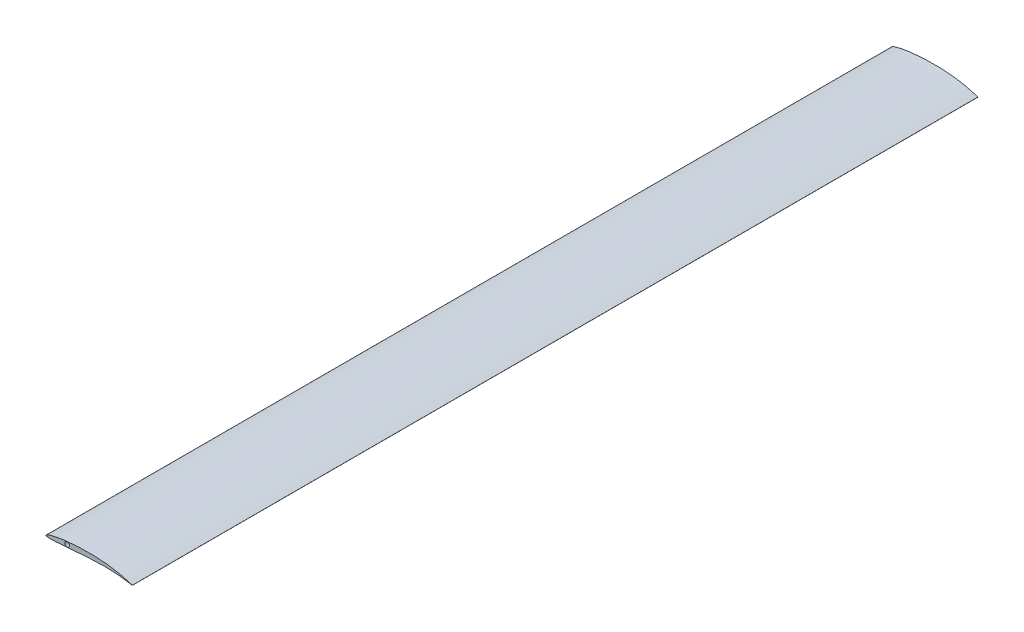
ISO-10303-21;
HEADER;
FILE_DESCRIPTION(('STEP AP214'),'2;1');
FILE_NAME('part.step','',(''),(''),'','','');
FILE_SCHEMA(('AUTOMOTIVE_DESIGN { 1 0 10303 214 1 1 1 1 }'));
ENDSEC;
DATA;
#1=APPLICATION_CONTEXT('core data for automotive mechanical design processes');
#2=APPLICATION_PROTOCOL_DEFINITION('international standard','automotive_design',2000,#1);
#3=PRODUCT_CONTEXT('',#1,'mechanical');
#4=PRODUCT('Part','Part','',(#3));
#5=PRODUCT_RELATED_PRODUCT_CATEGORY('part','',(#4));
#6=PRODUCT_DEFINITION_FORMATION('','',#4);
#7=PRODUCT_DEFINITION_CONTEXT('part definition',#1,'design');
#8=PRODUCT_DEFINITION('design','',#6,#7);
#9=PRODUCT_DEFINITION_SHAPE('','',#8);
#10=(LENGTH_UNIT() NAMED_UNIT(*) SI_UNIT(.MILLI.,.METRE.));
#11=(NAMED_UNIT(*) PLANE_ANGLE_UNIT() SI_UNIT($,.RADIAN.));
#12=(NAMED_UNIT(*) SI_UNIT($,.STERADIAN.) SOLID_ANGLE_UNIT());
#13=UNCERTAINTY_MEASURE_WITH_UNIT(LENGTH_MEASURE(1.E-05),#10,'distance_accuracy_value','');
#14=(GEOMETRIC_REPRESENTATION_CONTEXT(3) GLOBAL_UNCERTAINTY_ASSIGNED_CONTEXT((#13)) GLOBAL_UNIT_ASSIGNED_CONTEXT((#10,
#11,#12)) REPRESENTATION_CONTEXT('',''));
#15=CARTESIAN_POINT('',(0.,0.,0.));
#16=DIRECTION('',(0.,0.,1.));
#17=DIRECTION('',(1.,0.,0.));
#18=AXIS2_PLACEMENT_3D('',#15,#16,#17);
#19=CARTESIAN_POINT('',(0.525401804528747,0.872665163015105,1524.));
#20=DIRECTION('',(0.,0.,-1.));
#21=DIRECTION('',(-1.,0.,0.));
#22=AXIS2_PLACEMENT_3D('',#19,#20,#21);
#23=PLANE('',#22);
#24=CARTESIAN_POINT('',(155.702,0.09809226,1524.));
#25=CARTESIAN_POINT('',(155.3284558553,0.21710942035594,1524.));
#26=CARTESIAN_POINT('',(154.286379592531,0.549131644312494,1524.));
#27=CARTESIAN_POINT('',(152.394434018514,1.13581789793689,1524.));
#28=CARTESIAN_POINT('',(149.891446958605,1.88722412189287,1524.));
#29=CARTESIAN_POINT('',(145.793800914538,3.06570542874273,1524.));
#30=CARTESIAN_POINT('',(138.63018294362,4.96895950803595,1524.));
#31=CARTESIAN_POINT('',(130.995988523734,6.68001387034383,1524.));
#32=CARTESIAN_POINT('',(122.718135251343,8.23822641028946,1524.));
#33=CARTESIAN_POINT('',(116.895890211187,9.1669332436809,1524.));
#34=CARTESIAN_POINT('',(110.965655093805,9.93786873542115,1524.));
#35=CARTESIAN_POINT('',(106.439374347078,10.4355304241508,1524.));
#36=CARTESIAN_POINT('',(101.8800302122,10.8435128286841,1524.));
#37=CARTESIAN_POINT('',(97.3023620828505,11.1613375190947,1524.));
#38=CARTESIAN_POINT('',(92.7193250753117,11.3761631186527,1524.));
#39=CARTESIAN_POINT('',(88.1453758425879,11.5296260540284,1524.));
#40=CARTESIAN_POINT('',(83.5919730289418,11.6364959817345,1524.));
#41=CARTESIAN_POINT('',(77.5937160238076,11.7103246590463,1524.));
#42=CARTESIAN_POINT('',(71.6583323599073,11.685336347403,1524.));
#43=CARTESIAN_POINT('',(64.3955458542361,11.5289598804677,1524.));
#44=CARTESIAN_POINT('',(58.7294518068982,11.3089513302016,1524.));
#45=CARTESIAN_POINT('',(53.1798499910998,10.9924087613946,1524.));
#46=CARTESIAN_POINT('',(49.158789871168,10.7138031622318,1524.));
#47=CARTESIAN_POINT('',(45.2445946235121,10.3938147479918,1524.));
#48=CARTESIAN_POINT('',(41.4452023461841,10.0348604506325,1524.));
#49=CARTESIAN_POINT('',(37.7682829872048,9.63979813773975,1524.));
#50=CARTESIAN_POINT('',(34.2213123330204,9.21151904176136,1524.));
#51=CARTESIAN_POINT('',(30.8115271305712,8.75335646956328,1524.));
#52=CARTESIAN_POINT('',(27.5459898910303,8.2687115409572,1524.));
#53=CARTESIAN_POINT('',(24.4315558878002,7.76125975695687,1524.));
#54=CARTESIAN_POINT('',(21.474930217381,7.23477382786033,1524.));
#55=CARTESIAN_POINT('',(18.6826260388899,6.69326818166757,1524.));
#56=CARTESIAN_POINT('',(16.0610248859551,6.14072241384211,1524.));
#57=CARTESIAN_POINT('',(13.6163514767167,5.58123683702117,1524.));
#58=CARTESIAN_POINT('',(11.354657589497,5.01899174489703,1524.));
#59=CARTESIAN_POINT('',(9.28189004841098,4.45804318927709,1524.));
#60=CARTESIAN_POINT('',(7.40381333161797,3.90246845818611,1524.));
#61=CARTESIAN_POINT('',(5.72603374089783,3.35624415940243,1524.));
#62=CARTESIAN_POINT('',(4.25396605844636,2.82311362786691,1524.));
#63=CARTESIAN_POINT('',(2.99264591262698,2.30692318188395,1524.));
#64=CARTESIAN_POINT('',(1.94675417840804,1.81068520043617,1524.));
#65=CARTESIAN_POINT('',(1.11946567026023,1.33845579257681,1524.));
#66=CARTESIAN_POINT('',(0.512415950317857,0.888835225589004,1524.));
#67=CARTESIAN_POINT('',(0.119562153788262,0.462964377166334,1524.));
#68=CARTESIAN_POINT('',(-0.0492678595732266,0.0142016169626996,1524.));
#69=CARTESIAN_POINT('',(0.105897750369786,-0.415412747386477,1524.));
#70=CARTESIAN_POINT('',(0.520541366310002,-0.722853172688327,1524.));
#71=CARTESIAN_POINT('',(1.12920170506311,-0.970029586177184,1524.));
#72=CARTESIAN_POINT('',(1.9577398623943,-1.17009878108616,1524.));
#73=CARTESIAN_POINT('',(3.00247648729025,-1.32560916480063,1524.));
#74=CARTESIAN_POINT('',(4.26301779834516,-1.43690619309591,1524.));
#75=CARTESIAN_POINT('',(5.73422144562208,-1.50478830501902,1524.));
#76=CARTESIAN_POINT('',(7.41130069894125,-1.53045233437144,1524.));
#77=CARTESIAN_POINT('',(9.28876761435492,-1.51533320486841,1524.));
#78=CARTESIAN_POINT('',(11.3610140404189,-1.46108450467701,1524.));
#79=CARTESIAN_POINT('',(13.6222390898554,-1.36966255039926,1524.));
#80=CARTESIAN_POINT('',(16.0664917094409,-1.24309770203797,1524.));
#81=CARTESIAN_POINT('',(18.6876947710045,-1.083738204904,1524.));
#82=CARTESIAN_POINT('',(21.4796084463121,-0.893954737003242,1524.));
#83=CARTESIAN_POINT('',(24.4358612796768,-0.67648534031803,1524.));
#84=CARTESIAN_POINT('',(27.5499144660739,-0.434035782526698,1524.));
#85=CARTESIAN_POINT('',(30.8150706083519,-0.169587971307873,1524.));
#86=CARTESIAN_POINT('',(34.2244674982915,0.113769109898979,1524.));
#87=CARTESIAN_POINT('',(37.7710507217415,0.412820725321326,1524.));
#88=CARTESIAN_POINT('',(41.4475731590064,0.724258515605107,1524.));
#89=CARTESIAN_POINT('',(45.2465713873692,1.04472146189352,1524.));
#90=CARTESIAN_POINT('',(49.1603750794306,1.37067467274429,1524.));
#91=CARTESIAN_POINT('',(53.1810472874107,1.69875654472471,1524.));
#92=CARTESIAN_POINT('',(58.7310934112926,2.13891625095822,1524.));
#93=CARTESIAN_POINT('',(65.8715142279846,2.67438646003037,1524.));
#94=CARTESIAN_POINT('',(73.1340385714778,3.16363780617084,1524.));
#95=CARTESIAN_POINT('',(79.0693703699002,3.52254709679583,1524.));
#96=CARTESIAN_POINT('',(83.5908901555847,3.77384205750244,1524.));
#97=CARTESIAN_POINT('',(88.1441154412296,4.0021631409997,1524.));
#98=CARTESIAN_POINT('',(92.717191906114,4.20961080150113,1524.));
#99=CARTESIAN_POINT('',(97.2984728585409,4.3792036165322,1524.));
#100=CARTESIAN_POINT('',(101.875937349907,4.46664553107566,1524.));
#101=CARTESIAN_POINT('',(106.434975089222,4.48228755306944,1524.));
#102=CARTESIAN_POINT('',(110.961062662525,4.42400453658744,1524.));
#103=CARTESIAN_POINT('',(116.884864025516,4.25253430316624,1524.));
#104=CARTESIAN_POINT('',(124.077709926948,3.87360796895395,1524.));
#105=CARTESIAN_POINT('',(132.343195007114,3.18478996582521,1524.));
#106=CARTESIAN_POINT('',(138.866298944054,2.45410016104777,1524.));
#107=CARTESIAN_POINT('',(143.705151457092,1.8156145112589,1524.));
#108=CARTESIAN_POINT('',(146.962607739574,1.34652287539088,1524.));
#109=CARTESIAN_POINT('',(149.888855120236,0.893212117335907,1524.));
#110=CARTESIAN_POINT('',(152.392639903493,0.480978032682383,1524.));
#111=CARTESIAN_POINT('',(154.285403175287,0.155019879199055,1524.));
#112=CARTESIAN_POINT('',(155.328395834426,-0.0313380869618917,1524.));
#113=CARTESIAN_POINT('',(155.702,-0.09809226,1524.));
#114=B_SPLINE_CURVE_WITH_KNOTS('',3,(#24,#25,#26,#27,#28,#29,#30,#31,#32,#33,#34,#35,#36,#37,
#38,#39,#40,#41,#42,#43,#44,#45,#46,#47,#48,#49,#50,#51,#52,#53,#54,#55,#56,#57,#58,#59,#60,#61,
#62,#63,#64,#65,#66,#67,#68,#69,#70,#71,#72,#73,#74,#75,#76,#77,#78,#79,#80,#81,#82,#83,#84,#85,
#86,#87,#88,#89,#90,#91,#92,#93,#94,#95,#96,#97,#98,#99,#100,#101,#102,#103,#104,#105,#106,#107,
#108,#109,#110,#111,#112,#113),.UNSPECIFIED.,.F.,.F.,(4,1,1,1,1,1,1,1,1,1,1,1,1,1,1,1,1,1,1,1,1,
1,1,1,1,1,1,1,1,1,1,1,1,1,1,1,1,1,1,1,1,1,1,1,1,1,1,1,1,1,1,1,1,1,1,1,1,1,1,1,1,1,1,1,1,1,1,1,1,
1,1,1,1,1,1,1,1,1,1,1,1,1,1,1,1,1,1,4),(0.,0.00372899313572629,0.0104027737709402,
0.0188405681091252,0.0285857090219877,0.0509568654463618,0.0893342705761814,0.102976570028767,
0.131071144946394,0.145402462066134,0.159853792798743,0.174379924165424,0.188939765995605,
0.203496108228615,0.218017345652983,0.232469301823207,0.246817477060529,0.275073666804327,
0.288921089564929,0.315912881852729,0.329003976978422,0.341791348126529,0.354250441074044,
0.366357574957908,0.378089701143569,0.389424235307972,0.400339091312672,0.410812773460301,
0.420824000924857,0.430352033095254,0.439376412436803,0.447877060843406,0.455834383426044,
0.463229144178333,0.470042802143181,0.476257372386531,0.481856008580791,0.486823220679453,
0.491145841818725,0.49481444479107,0.497826693193043,0.50019535908403,0.501969932436351,
0.503300070481987,0.504508603814003,0.506012741551414,0.508062770734561,0.510747121987725,
0.514093104606869,0.518105082605802,0.522777317910467,0.528099107282482,0.534056683384844,
0.54063448129877,0.547815449226327,0.555581622315945,0.563914059121092,0.572793129232771,
0.582198375734924,0.592108706915711,0.602502417276948,0.613356987376676,0.624649416693531,
0.636355908808304,0.648451946947934,0.660912408031849,0.673711424560329,0.686822170180073,
0.713868083313977,0.741818751280604,0.75605650564263,0.770425668646667,0.784891945827016,
0.799419293905974,0.813967731261913,0.82849578318469,0.842964095160687,0.857330143238578,
0.871547876317039,0.899330310053235,0.925831588486519,0.950429235569147,0.961757467348133,
0.972254713902714,0.981731904954293,0.989922337683984,0.996390140824557,1.),.UNSPECIFIED.);
#115=CARTESIAN_POINT('',(155.702,0.09809226,1524.));
#116=VERTEX_POINT('',#115);
#117=CARTESIAN_POINT('',(155.702,-0.09809226,1524.));
#118=VERTEX_POINT('',#117);
#119=EDGE_CURVE('E69',#116,#118,#114,.T.);
#120=ORIENTED_EDGE('',*,*,#119,.T.);
#121=DIRECTION('',(0.,1.,0.));
#122=VECTOR('',#121,1.);
#123=CARTESIAN_POINT('',(155.702,0.09809226,1524.));
#124=LINE('',#123,#122);
#125=EDGE_CURVE('E54',#118,#116,#124,.T.);
#126=ORIENTED_EDGE('',*,*,#125,.T.);
#127=EDGE_LOOP('',(#120,#126));
#128=FACE_BOUND('',#127,.T.);
#129=CARTESIAN_POINT('',(38.058872586786,5.05107898487344,1524.));
#130=DIRECTION('',(0.,0.,1.));
#131=DIRECTION('',(1.,0.,0.));
#132=AXIS2_PLACEMENT_3D('',#129,#130,#131);
#133=CIRCLE('',#132,4.19056940693637);
#134=CARTESIAN_POINT('',(42.2494419937224,5.05107898487344,1524.));
#135=VERTEX_POINT('',#134);
#136=EDGE_CURVE('E75',#135,#135,#133,.T.);
#137=ORIENTED_EDGE('',*,*,#136,.F.);
#138=EDGE_LOOP('',(#137));
#139=FACE_BOUND('',#138,.T.);
#140=ADVANCED_FACE('F37',(#128,#139),#23,.F.);
#141=CARTESIAN_POINT('',(0.525401804528747,0.872665163015105,0.));
#142=DIRECTION('',(0.,0.,-1.));
#143=DIRECTION('',(-1.,0.,0.));
#144=AXIS2_PLACEMENT_3D('',#141,#142,#143);
#145=PLANE('',#144);
#146=CARTESIAN_POINT('',(155.702,0.09809226,0.));
#147=CARTESIAN_POINT('',(155.3284558553,0.21710942035594,0.));
#148=CARTESIAN_POINT('',(154.286379592531,0.549131644312494,0.));
#149=CARTESIAN_POINT('',(152.394434018514,1.13581789793689,0.));
#150=CARTESIAN_POINT('',(149.891446958605,1.88722412189287,0.));
#151=CARTESIAN_POINT('',(145.793800914538,3.06570542874273,0.));
#152=CARTESIAN_POINT('',(138.63018294362,4.96895950803595,0.));
#153=CARTESIAN_POINT('',(130.995988523734,6.68001387034383,0.));
#154=CARTESIAN_POINT('',(122.718135251343,8.23822641028946,0.));
#155=CARTESIAN_POINT('',(116.895890211187,9.1669332436809,0.));
#156=CARTESIAN_POINT('',(110.965655093805,9.93786873542115,0.));
#157=CARTESIAN_POINT('',(106.439374347078,10.4355304241508,0.));
#158=CARTESIAN_POINT('',(101.8800302122,10.8435128286841,0.));
#159=CARTESIAN_POINT('',(97.3023620828505,11.1613375190947,0.));
#160=CARTESIAN_POINT('',(92.7193250753117,11.3761631186527,0.));
#161=CARTESIAN_POINT('',(88.1453758425879,11.5296260540284,0.));
#162=CARTESIAN_POINT('',(83.5919730289418,11.6364959817345,0.));
#163=CARTESIAN_POINT('',(77.5937160238076,11.7103246590463,0.));
#164=CARTESIAN_POINT('',(71.6583323599073,11.685336347403,0.));
#165=CARTESIAN_POINT('',(64.3955458542361,11.5289598804677,0.));
#166=CARTESIAN_POINT('',(58.7294518068982,11.3089513302016,0.));
#167=CARTESIAN_POINT('',(53.1798499910998,10.9924087613946,0.));
#168=CARTESIAN_POINT('',(49.158789871168,10.7138031622318,0.));
#169=CARTESIAN_POINT('',(45.2445946235121,10.3938147479918,0.));
#170=CARTESIAN_POINT('',(41.4452023461841,10.0348604506325,0.));
#171=CARTESIAN_POINT('',(37.7682829872048,9.63979813773975,0.));
#172=CARTESIAN_POINT('',(34.2213123330204,9.21151904176136,0.));
#173=CARTESIAN_POINT('',(30.8115271305712,8.75335646956328,0.));
#174=CARTESIAN_POINT('',(27.5459898910303,8.2687115409572,0.));
#175=CARTESIAN_POINT('',(24.4315558878002,7.76125975695687,0.));
#176=CARTESIAN_POINT('',(21.474930217381,7.23477382786033,0.));
#177=CARTESIAN_POINT('',(18.6826260388899,6.69326818166757,0.));
#178=CARTESIAN_POINT('',(16.0610248859551,6.14072241384211,0.));
#179=CARTESIAN_POINT('',(13.6163514767167,5.58123683702117,0.));
#180=CARTESIAN_POINT('',(11.354657589497,5.01899174489703,0.));
#181=CARTESIAN_POINT('',(9.28189004841098,4.45804318927709,0.));
#182=CARTESIAN_POINT('',(7.40381333161797,3.90246845818611,0.));
#183=CARTESIAN_POINT('',(5.72603374089783,3.35624415940243,0.));
#184=CARTESIAN_POINT('',(4.25396605844636,2.82311362786691,0.));
#185=CARTESIAN_POINT('',(2.99264591262698,2.30692318188395,0.));
#186=CARTESIAN_POINT('',(1.94675417840804,1.81068520043617,0.));
#187=CARTESIAN_POINT('',(1.11946567026023,1.33845579257681,0.));
#188=CARTESIAN_POINT('',(0.512415950317857,0.888835225589004,0.));
#189=CARTESIAN_POINT('',(0.119562153788262,0.462964377166334,0.));
#190=CARTESIAN_POINT('',(-0.0492678595732266,0.0142016169626996,0.));
#191=CARTESIAN_POINT('',(0.105897750369786,-0.415412747386477,0.));
#192=CARTESIAN_POINT('',(0.520541366310002,-0.722853172688327,0.));
#193=CARTESIAN_POINT('',(1.12920170506311,-0.970029586177184,0.));
#194=CARTESIAN_POINT('',(1.9577398623943,-1.17009878108616,0.));
#195=CARTESIAN_POINT('',(3.00247648729025,-1.32560916480063,0.));
#196=CARTESIAN_POINT('',(4.26301779834516,-1.43690619309591,0.));
#197=CARTESIAN_POINT('',(5.73422144562208,-1.50478830501902,0.));
#198=CARTESIAN_POINT('',(7.41130069894125,-1.53045233437144,0.));
#199=CARTESIAN_POINT('',(9.28876761435492,-1.51533320486841,0.));
#200=CARTESIAN_POINT('',(11.3610140404189,-1.46108450467701,0.));
#201=CARTESIAN_POINT('',(13.6222390898554,-1.36966255039926,0.));
#202=CARTESIAN_POINT('',(16.0664917094409,-1.24309770203797,0.));
#203=CARTESIAN_POINT('',(18.6876947710045,-1.083738204904,0.));
#204=CARTESIAN_POINT('',(21.4796084463121,-0.893954737003242,0.));
#205=CARTESIAN_POINT('',(24.4358612796768,-0.67648534031803,0.));
#206=CARTESIAN_POINT('',(27.5499144660739,-0.434035782526698,0.));
#207=CARTESIAN_POINT('',(30.8150706083519,-0.169587971307873,0.));
#208=CARTESIAN_POINT('',(34.2244674982915,0.113769109898979,0.));
#209=CARTESIAN_POINT('',(37.7710507217415,0.412820725321326,0.));
#210=CARTESIAN_POINT('',(41.4475731590064,0.724258515605107,0.));
#211=CARTESIAN_POINT('',(45.2465713873692,1.04472146189352,0.));
#212=CARTESIAN_POINT('',(49.1603750794306,1.37067467274429,0.));
#213=CARTESIAN_POINT('',(53.1810472874107,1.69875654472471,0.));
#214=CARTESIAN_POINT('',(58.7310934112926,2.13891625095822,0.));
#215=CARTESIAN_POINT('',(65.8715142279846,2.67438646003037,0.));
#216=CARTESIAN_POINT('',(73.1340385714778,3.16363780617084,0.));
#217=CARTESIAN_POINT('',(79.0693703699002,3.52254709679583,0.));
#218=CARTESIAN_POINT('',(83.5908901555847,3.77384205750244,0.));
#219=CARTESIAN_POINT('',(88.1441154412296,4.0021631409997,0.));
#220=CARTESIAN_POINT('',(92.717191906114,4.20961080150113,0.));
#221=CARTESIAN_POINT('',(97.2984728585409,4.3792036165322,0.));
#222=CARTESIAN_POINT('',(101.875937349907,4.46664553107566,0.));
#223=CARTESIAN_POINT('',(106.434975089222,4.48228755306944,0.));
#224=CARTESIAN_POINT('',(110.961062662525,4.42400453658744,0.));
#225=CARTESIAN_POINT('',(116.884864025516,4.25253430316624,0.));
#226=CARTESIAN_POINT('',(124.077709926948,3.87360796895395,0.));
#227=CARTESIAN_POINT('',(132.343195007114,3.18478996582521,0.));
#228=CARTESIAN_POINT('',(138.866298944054,2.45410016104777,0.));
#229=CARTESIAN_POINT('',(143.705151457092,1.8156145112589,0.));
#230=CARTESIAN_POINT('',(146.962607739574,1.34652287539088,0.));
#231=CARTESIAN_POINT('',(149.888855120236,0.893212117335907,0.));
#232=CARTESIAN_POINT('',(152.392639903493,0.480978032682383,0.));
#233=CARTESIAN_POINT('',(154.285403175287,0.155019879199055,0.));
#234=CARTESIAN_POINT('',(155.328395834426,-0.0313380869618917,0.));
#235=CARTESIAN_POINT('',(155.702,-0.09809226,0.));
#236=B_SPLINE_CURVE_WITH_KNOTS('',3,(#146,#147,#148,#149,#150,#151,#152,#153,#154,#155,#156,
#157,#158,#159,#160,#161,#162,#163,#164,#165,#166,#167,#168,#169,#170,#171,#172,#173,#174,#175,
#176,#177,#178,#179,#180,#181,#182,#183,#184,#185,#186,#187,#188,#189,#190,#191,#192,#193,#194,
#195,#196,#197,#198,#199,#200,#201,#202,#203,#204,#205,#206,#207,#208,#209,#210,#211,#212,#213,
#214,#215,#216,#217,#218,#219,#220,#221,#222,#223,#224,#225,#226,#227,#228,#229,#230,#231,#232,
#233,#234,#235),.UNSPECIFIED.,.F.,.F.,(4,1,1,1,1,1,1,1,1,1,1,1,1,1,1,1,1,1,1,1,1,1,1,1,1,1,1,1,
1,1,1,1,1,1,1,1,1,1,1,1,1,1,1,1,1,1,1,1,1,1,1,1,1,1,1,1,1,1,1,1,1,1,1,1,1,1,1,1,1,1,1,1,1,1,1,1,
1,1,1,1,1,1,1,1,1,1,1,4),(0.,0.00372899313572629,0.0104027737709402,0.0188405681091252,
0.0285857090219877,0.0509568654463618,0.0893342705761814,0.102976570028767,0.131071144946394,
0.145402462066134,0.159853792798743,0.174379924165424,0.188939765995605,0.203496108228615,
0.218017345652983,0.232469301823207,0.246817477060529,0.275073666804327,0.288921089564929,
0.315912881852729,0.329003976978422,0.341791348126529,0.354250441074044,0.366357574957908,
0.378089701143569,0.389424235307972,0.400339091312672,0.410812773460301,0.420824000924857,
0.430352033095254,0.439376412436803,0.447877060843406,0.455834383426044,0.463229144178333,
0.470042802143181,0.476257372386531,0.481856008580791,0.486823220679453,0.491145841818725,
0.49481444479107,0.497826693193043,0.50019535908403,0.501969932436351,0.503300070481987,
0.504508603814003,0.506012741551414,0.508062770734561,0.510747121987725,0.514093104606869,
0.518105082605802,0.522777317910467,0.528099107282482,0.534056683384844,0.54063448129877,
0.547815449226327,0.555581622315945,0.563914059121092,0.572793129232771,0.582198375734924,
0.592108706915711,0.602502417276948,0.613356987376676,0.624649416693531,0.636355908808304,
0.648451946947934,0.660912408031849,0.673711424560329,0.686822170180073,0.713868083313977,
0.741818751280604,0.75605650564263,0.770425668646667,0.784891945827016,0.799419293905974,
0.813967731261913,0.82849578318469,0.842964095160687,0.857330143238578,0.871547876317039,
0.899330310053235,0.925831588486519,0.950429235569147,0.961757467348133,0.972254713902714,
0.981731904954293,0.989922337683984,0.996390140824557,1.),.UNSPECIFIED.);
#237=CARTESIAN_POINT('',(155.702,0.09809226,0.));
#238=VERTEX_POINT('',#237);
#239=CARTESIAN_POINT('',(155.702,-0.09809226,0.));
#240=VERTEX_POINT('',#239);
#241=EDGE_CURVE('E70',#238,#240,#236,.T.);
#242=ORIENTED_EDGE('',*,*,#241,.F.);
#243=DIRECTION('',(0.,1.,0.));
#244=VECTOR('',#243,1.);
#245=CARTESIAN_POINT('',(155.702,0.09809226,0.));
#246=LINE('',#245,#244);
#247=EDGE_CURVE('E62',#240,#238,#246,.T.);
#248=ORIENTED_EDGE('',*,*,#247,.F.);
#249=EDGE_LOOP('',(#242,#248));
#250=FACE_BOUND('',#249,.T.);
#251=CARTESIAN_POINT('',(38.058872586786,5.05107898487344,0.));
#252=DIRECTION('',(0.,0.,1.));
#253=DIRECTION('',(1.,0.,0.));
#254=AXIS2_PLACEMENT_3D('',#251,#252,#253);
#255=CIRCLE('',#254,4.19056940693637);
#256=CARTESIAN_POINT('',(42.2494419937224,5.05107898487344,0.));
#257=VERTEX_POINT('',#256);
#258=EDGE_CURVE('E78',#257,#257,#255,.T.);
#259=ORIENTED_EDGE('',*,*,#258,.T.);
#260=EDGE_LOOP('',(#259));
#261=FACE_BOUND('',#260,.T.);
#262=ADVANCED_FACE('F73',(#250,#261),#145,.T.);
#263=DIRECTION('',(0.,0.,-1.));
#264=VECTOR('',#263,1.);
#265=SURFACE_OF_LINEAR_EXTRUSION('',#114,#264);
#266=ORIENTED_EDGE('',*,*,#241,.T.);
#267=DIRECTION('',(0.,0.,-1.));
#268=VECTOR('',#267,1.);
#269=CARTESIAN_POINT('',(155.702,-0.09809226,1524.));
#270=LINE('',#269,#268);
#271=EDGE_CURVE('E11',#118,#240,#270,.T.);
#272=ORIENTED_EDGE('',*,*,#271,.F.);
#273=ORIENTED_EDGE('',*,*,#119,.F.);
#274=DIRECTION('',(0.,0.,-1.));
#275=VECTOR('',#274,1.);
#276=CARTESIAN_POINT('',(155.702,0.09809226,1524.));
#277=LINE('',#276,#275);
#278=EDGE_CURVE('E47',#116,#238,#277,.T.);
#279=ORIENTED_EDGE('',*,*,#278,.T.);
#280=EDGE_LOOP('',(#266,#272,#273,#279));
#281=FACE_BOUND('',#280,.T.);
#282=ADVANCED_FACE('F39',(#281),#265,.F.);
#283=CARTESIAN_POINT('',(155.702,0.09809226,1524.));
#284=DIRECTION('',(-1.,0.,0.));
#285=DIRECTION('',(0.,0.,1.));
#286=AXIS2_PLACEMENT_3D('',#283,#284,#285);
#287=PLANE('',#286);
#288=ORIENTED_EDGE('',*,*,#247,.T.);
#289=ORIENTED_EDGE('',*,*,#278,.F.);
#290=ORIENTED_EDGE('',*,*,#125,.F.);
#291=ORIENTED_EDGE('',*,*,#271,.T.);
#292=EDGE_LOOP('',(#288,#289,#290,#291));
#293=FACE_BOUND('',#292,.T.);
#294=ADVANCED_FACE('F65',(#293),#287,.F.);
#295=CARTESIAN_POINT('',(38.058872586786,5.05107898487344,1524.));
#296=DIRECTION('',(0.,0.,-1.));
#297=DIRECTION('',(-1.,0.,0.));
#298=AXIS2_PLACEMENT_3D('',#295,#296,#297);
#299=CYLINDRICAL_SURFACE('',#298,4.19056940693637);
#300=ORIENTED_EDGE('',*,*,#136,.T.);
#301=EDGE_LOOP('',(#300));
#302=FACE_BOUND('',#301,.T.);
#303=ORIENTED_EDGE('',*,*,#258,.F.);
#304=EDGE_LOOP('',(#303));
#305=FACE_BOUND('',#304,.T.);
#306=ADVANCED_FACE('F96',(#302,#305),#299,.F.);
#307=CLOSED_SHELL('',(#140,#262,#282,#294,#306));
#308=MANIFOLD_SOLID_BREP('B2',#307);
#309=ADVANCED_BREP_SHAPE_REPRESENTATION('',(#18,#308),#14);
#310=SHAPE_DEFINITION_REPRESENTATION(#9,#309);
ENDSEC;
END-ISO-10303-21;
